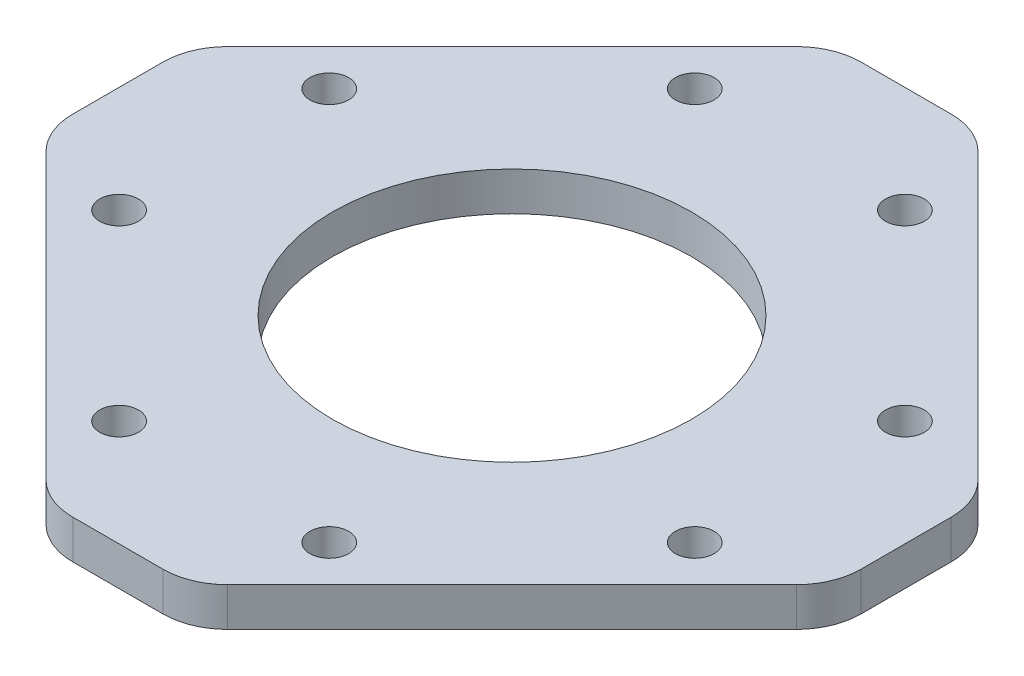
ISO-10303-21;
HEADER;
FILE_DESCRIPTION(('STEP AP214'),'2;1');
FILE_NAME('part.step','',(''),(''),'','','');
FILE_SCHEMA(('AUTOMOTIVE_DESIGN { 1 0 10303 214 1 1 1 1 }'));
ENDSEC;
DATA;
#1=APPLICATION_CONTEXT('core data for automotive mechanical design processes');
#2=APPLICATION_PROTOCOL_DEFINITION('international standard','automotive_design',2000,#1);
#3=PRODUCT_CONTEXT('',#1,'mechanical');
#4=PRODUCT('Part','Part','',(#3));
#5=PRODUCT_RELATED_PRODUCT_CATEGORY('part','',(#4));
#6=PRODUCT_DEFINITION_FORMATION('','',#4);
#7=PRODUCT_DEFINITION_CONTEXT('part definition',#1,'design');
#8=PRODUCT_DEFINITION('design','',#6,#7);
#9=PRODUCT_DEFINITION_SHAPE('','',#8);
#10=(LENGTH_UNIT() NAMED_UNIT(*) SI_UNIT(.MILLI.,.METRE.));
#11=(NAMED_UNIT(*) PLANE_ANGLE_UNIT() SI_UNIT($,.RADIAN.));
#12=(NAMED_UNIT(*) SI_UNIT($,.STERADIAN.) SOLID_ANGLE_UNIT());
#13=UNCERTAINTY_MEASURE_WITH_UNIT(LENGTH_MEASURE(1.E-05),#10,'distance_accuracy_value','');
#14=(GEOMETRIC_REPRESENTATION_CONTEXT(3) GLOBAL_UNCERTAINTY_ASSIGNED_CONTEXT((#13)) GLOBAL_UNIT_ASSIGNED_CONTEXT((#10,
#11,#12)) REPRESENTATION_CONTEXT('',''));
#15=CARTESIAN_POINT('',(0.,0.,0.));
#16=DIRECTION('',(0.,0.,1.));
#17=DIRECTION('',(1.,0.,0.));
#18=AXIS2_PLACEMENT_3D('',#15,#16,#17);
#19=CARTESIAN_POINT('',(3.49137802864851,3.,-25.5));
#20=DIRECTION('',(0.,1.,0.));
#21=DIRECTION('',(0.,0.,1.));
#22=AXIS2_PLACEMENT_3D('',#19,#20,#21);
#23=PLANE('',#22);
#24=CARTESIAN_POINT('',(-22.2738636073763,3.,-8.13172798364529));
#25=DIRECTION('',(0.,1.,0.));
#26=DIRECTION('',(0.,0.,1.));
#27=AXIS2_PLACEMENT_3D('',#24,#25,#26);
#28=CIRCLE('',#27,1.4999999999999);
#29=CARTESIAN_POINT('',(-22.2738636073763,3.,-6.63172798364539));
#30=VERTEX_POINT('',#29);
#31=EDGE_CURVE('E372',#30,#30,#28,.T.);
#32=ORIENTED_EDGE('',*,*,#31,.F.);
#33=EDGE_LOOP('',(#32));
#34=FACE_BOUND('',#33,.T.);
#35=CARTESIAN_POINT('',(-8.1317279836453,3.,-22.2738636073762));
#36=DIRECTION('',(0.,1.,0.));
#37=DIRECTION('',(0.,0.,1.));
#38=AXIS2_PLACEMENT_3D('',#35,#36,#37);
#39=CIRCLE('',#38,1.5);
#40=CARTESIAN_POINT('',(-8.1317279836453,3.,-20.7738636073762));
#41=VERTEX_POINT('',#40);
#42=EDGE_CURVE('E384',#41,#41,#39,.T.);
#43=ORIENTED_EDGE('',*,*,#42,.F.);
#44=EDGE_LOOP('',(#43));
#45=FACE_BOUND('',#44,.T.);
#46=CARTESIAN_POINT('',(22.2738636073762,3.,-8.1317279836453));
#47=DIRECTION('',(0.,1.,0.));
#48=DIRECTION('',(0.,0.,1.));
#49=AXIS2_PLACEMENT_3D('',#46,#47,#48);
#50=CIRCLE('',#49,1.5);
#51=CARTESIAN_POINT('',(22.2738636073762,3.,-6.6317279836453));
#52=VERTEX_POINT('',#51);
#53=EDGE_CURVE('E396',#52,#52,#50,.T.);
#54=ORIENTED_EDGE('',*,*,#53,.F.);
#55=EDGE_LOOP('',(#54));
#56=FACE_BOUND('',#55,.T.);
#57=CARTESIAN_POINT('',(8.13172798364529,3.,22.2738636073762));
#58=DIRECTION('',(0.,1.,0.));
#59=DIRECTION('',(0.,0.,1.));
#60=AXIS2_PLACEMENT_3D('',#57,#58,#59);
#61=CIRCLE('',#60,1.5);
#62=CARTESIAN_POINT('',(8.13172798364529,3.,23.7738636073762));
#63=VERTEX_POINT('',#62);
#64=EDGE_CURVE('E408',#63,#63,#61,.T.);
#65=ORIENTED_EDGE('',*,*,#64,.F.);
#66=EDGE_LOOP('',(#65));
#67=FACE_BOUND('',#66,.T.);
#68=CARTESIAN_POINT('',(3.49137802864851,3.,-25.5));
#69=DIRECTION('',(0.,1.,0.));
#70=DIRECTION('',(0.,0.,1.));
#71=AXIS2_PLACEMENT_3D('',#68,#69,#70);
#72=CIRCLE('',#71,4.99999999999999);
#73=CARTESIAN_POINT('',(7.02691193458125,3.,-29.0355339059327));
#74=VERTEX_POINT('',#73);
#75=CARTESIAN_POINT('',(3.49137802864851,3.,-30.5));
#76=VERTEX_POINT('',#75);
#77=EDGE_CURVE('E218',#74,#76,#72,.T.);
#78=ORIENTED_EDGE('',*,*,#77,.T.);
#79=DIRECTION('',(-1.,0.,0.));
#80=VECTOR('',#79,1.);
#81=CARTESIAN_POINT('',(3.49137802864851,3.,-30.5));
#82=LINE('',#81,#80);
#83=CARTESIAN_POINT('',(-3.4913780286485,3.,-30.5));
#84=VERTEX_POINT('',#83);
#85=EDGE_CURVE('E126',#76,#84,#82,.T.);
#86=ORIENTED_EDGE('',*,*,#85,.T.);
#87=CARTESIAN_POINT('',(-3.4913780286485,3.,-25.5));
#88=DIRECTION('',(0.,1.,0.));
#89=DIRECTION('',(0.,0.,1.));
#90=AXIS2_PLACEMENT_3D('',#87,#88,#89);
#91=CIRCLE('',#90,4.99999999999999);
#92=CARTESIAN_POINT('',(-7.02691193458124,3.,-29.0355339059327));
#93=VERTEX_POINT('',#92);
#94=EDGE_CURVE('E257',#84,#93,#91,.T.);
#95=ORIENTED_EDGE('',*,*,#94,.T.);
#96=DIRECTION('',(-0.707106781186547,0.,0.707106781186548));
#97=VECTOR('',#96,1.);
#98=CARTESIAN_POINT('',(-7.02691193458124,3.,-29.0355339059327));
#99=LINE('',#98,#97);
#100=CARTESIAN_POINT('',(-29.0355339059327,3.,-7.02691193458124));
#101=VERTEX_POINT('',#100);
#102=EDGE_CURVE('E276',#93,#101,#99,.T.);
#103=ORIENTED_EDGE('',*,*,#102,.T.);
#104=CARTESIAN_POINT('',(-25.5,3.,-3.4913780286485));
#105=DIRECTION('',(0.,1.,0.));
#106=DIRECTION('',(0.,0.,1.));
#107=AXIS2_PLACEMENT_3D('',#104,#105,#106);
#108=CIRCLE('',#107,4.99999999999999);
#109=CARTESIAN_POINT('',(-30.5,3.,-3.4913780286485));
#110=VERTEX_POINT('',#109);
#111=EDGE_CURVE('E273',#101,#110,#108,.T.);
#112=ORIENTED_EDGE('',*,*,#111,.T.);
#113=DIRECTION('',(0.,0.,1.));
#114=VECTOR('',#113,1.);
#115=CARTESIAN_POINT('',(-30.5,3.,-3.4913780286485));
#116=LINE('',#115,#114);
#117=CARTESIAN_POINT('',(-30.5,3.,3.4913780286485));
#118=VERTEX_POINT('',#117);
#119=EDGE_CURVE('E275',#110,#118,#116,.T.);
#120=ORIENTED_EDGE('',*,*,#119,.T.);
#121=CARTESIAN_POINT('',(-25.5,3.,3.4913780286485));
#122=DIRECTION('',(0.,1.,0.));
#123=DIRECTION('',(0.,0.,1.));
#124=AXIS2_PLACEMENT_3D('',#121,#122,#123);
#125=CIRCLE('',#124,4.99999999999999);
#126=CARTESIAN_POINT('',(-29.0355339059327,3.,7.02691193458123));
#127=VERTEX_POINT('',#126);
#128=EDGE_CURVE('E278',#118,#127,#125,.T.);
#129=ORIENTED_EDGE('',*,*,#128,.T.);
#130=DIRECTION('',(0.707106781186547,0.,0.707106781186548));
#131=VECTOR('',#130,1.);
#132=CARTESIAN_POINT('',(-29.0355339059327,3.,7.02691193458123));
#133=LINE('',#132,#131);
#134=CARTESIAN_POINT('',(-7.02691193458126,3.,29.0355339059327));
#135=VERTEX_POINT('',#134);
#136=EDGE_CURVE('E284',#127,#135,#133,.T.);
#137=ORIENTED_EDGE('',*,*,#136,.T.);
#138=CARTESIAN_POINT('',(-3.49137802864851,3.,25.5));
#139=DIRECTION('',(0.,1.,0.));
#140=DIRECTION('',(0.,0.,1.));
#141=AXIS2_PLACEMENT_3D('',#138,#139,#140);
#142=CIRCLE('',#141,4.99999999999999);
#143=CARTESIAN_POINT('',(-3.49137802864849,3.,30.5));
#144=VERTEX_POINT('',#143);
#145=EDGE_CURVE('E286',#135,#144,#142,.T.);
#146=ORIENTED_EDGE('',*,*,#145,.T.);
#147=DIRECTION('',(1.,0.,0.));
#148=VECTOR('',#147,1.);
#149=CARTESIAN_POINT('',(-3.49137802864849,3.,30.5));
#150=LINE('',#149,#148);
#151=CARTESIAN_POINT('',(3.49137802864853,3.,30.5));
#152=VERTEX_POINT('',#151);
#153=EDGE_CURVE('E288',#144,#152,#150,.T.);
#154=ORIENTED_EDGE('',*,*,#153,.T.);
#155=CARTESIAN_POINT('',(3.49137802864851,3.,25.5));
#156=DIRECTION('',(0.,1.,0.));
#157=DIRECTION('',(0.,0.,1.));
#158=AXIS2_PLACEMENT_3D('',#155,#156,#157);
#159=CIRCLE('',#158,4.99999999999999);
#160=CARTESIAN_POINT('',(7.02691193458125,3.,29.0355339059327));
#161=VERTEX_POINT('',#160);
#162=EDGE_CURVE('E290',#152,#161,#159,.T.);
#163=ORIENTED_EDGE('',*,*,#162,.T.);
#164=DIRECTION('',(0.707106781186547,0.,-0.707106781186548));
#165=VECTOR('',#164,1.);
#166=CARTESIAN_POINT('',(7.02691193458125,3.,29.0355339059327));
#167=LINE('',#166,#165);
#168=CARTESIAN_POINT('',(29.0355339059327,3.,7.02691193458124));
#169=VERTEX_POINT('',#168);
#170=EDGE_CURVE('E292',#161,#169,#167,.T.);
#171=ORIENTED_EDGE('',*,*,#170,.T.);
#172=CARTESIAN_POINT('',(25.5,3.,3.4913780286485));
#173=DIRECTION('',(0.,1.,0.));
#174=DIRECTION('',(0.,0.,1.));
#175=AXIS2_PLACEMENT_3D('',#172,#173,#174);
#176=CIRCLE('',#175,4.99999999999999);
#177=CARTESIAN_POINT('',(30.5,3.,3.4913780286485));
#178=VERTEX_POINT('',#177);
#179=EDGE_CURVE('E169',#169,#178,#176,.T.);
#180=ORIENTED_EDGE('',*,*,#179,.T.);
#181=DIRECTION('',(0.,0.,-1.));
#182=VECTOR('',#181,1.);
#183=CARTESIAN_POINT('',(30.5,3.,3.4913780286485));
#184=LINE('',#183,#182);
#185=CARTESIAN_POINT('',(30.5,3.,-3.49137802864851));
#186=VERTEX_POINT('',#185);
#187=EDGE_CURVE('E163',#178,#186,#184,.T.);
#188=ORIENTED_EDGE('',*,*,#187,.T.);
#189=CARTESIAN_POINT('',(25.5,3.,-3.49137802864851));
#190=DIRECTION('',(0.,1.,0.));
#191=DIRECTION('',(0.,0.,1.));
#192=AXIS2_PLACEMENT_3D('',#189,#190,#191);
#193=CIRCLE('',#192,4.99999999999999);
#194=CARTESIAN_POINT('',(29.0355339059327,3.,-7.02691193458125));
#195=VERTEX_POINT('',#194);
#196=EDGE_CURVE('E167',#186,#195,#193,.T.);
#197=ORIENTED_EDGE('',*,*,#196,.T.);
#198=DIRECTION('',(-0.707106781186547,0.,-0.707106781186547));
#199=VECTOR('',#198,1.);
#200=CARTESIAN_POINT('',(29.0355339059327,3.,-7.02691193458125));
#201=LINE('',#200,#199);
#202=EDGE_CURVE('E59',#195,#74,#201,.T.);
#203=ORIENTED_EDGE('',*,*,#202,.T.);
#204=EDGE_LOOP('',(#78,#86,#95,#103,#112,#120,#129,#137,#146,#154,#163,#171,#180,#188,#197,#203));
#205=FACE_BOUND('',#204,.T.);
#206=CARTESIAN_POINT('',(-8.1317279836453,3.,22.2738636073763));
#207=DIRECTION('',(0.,1.,0.));
#208=DIRECTION('',(0.,0.,1.));
#209=AXIS2_PLACEMENT_3D('',#206,#207,#208);
#210=CIRCLE('',#209,1.5);
#211=CARTESIAN_POINT('',(-8.1317279836453,3.,23.7738636073763));
#212=VERTEX_POINT('',#211);
#213=EDGE_CURVE('E191',#212,#212,#210,.T.);
#214=ORIENTED_EDGE('',*,*,#213,.F.);
#215=EDGE_LOOP('',(#214));
#216=FACE_BOUND('',#215,.T.);
#217=CARTESIAN_POINT('',(22.2738636073762,3.,8.1317279836453));
#218=DIRECTION('',(0.,1.,0.));
#219=DIRECTION('',(0.,0.,1.));
#220=AXIS2_PLACEMENT_3D('',#217,#218,#219);
#221=CIRCLE('',#220,1.5);
#222=CARTESIAN_POINT('',(22.2738636073762,3.,9.6317279836453));
#223=VERTEX_POINT('',#222);
#224=EDGE_CURVE('E402',#223,#223,#221,.T.);
#225=ORIENTED_EDGE('',*,*,#224,.F.);
#226=EDGE_LOOP('',(#225));
#227=FACE_BOUND('',#226,.T.);
#228=CARTESIAN_POINT('',(8.1317279836453,3.,-22.2738636073762));
#229=DIRECTION('',(0.,1.,0.));
#230=DIRECTION('',(0.,0.,1.));
#231=AXIS2_PLACEMENT_3D('',#228,#229,#230);
#232=CIRCLE('',#231,1.5);
#233=CARTESIAN_POINT('',(8.1317279836453,3.,-20.7738636073762));
#234=VERTEX_POINT('',#233);
#235=EDGE_CURVE('E390',#234,#234,#232,.T.);
#236=ORIENTED_EDGE('',*,*,#235,.F.);
#237=EDGE_LOOP('',(#236));
#238=FACE_BOUND('',#237,.T.);
#239=CARTESIAN_POINT('',(-22.2738636073762,3.,8.1317279836453));
#240=DIRECTION('',(0.,1.,0.));
#241=DIRECTION('',(0.,0.,1.));
#242=AXIS2_PLACEMENT_3D('',#239,#240,#241);
#243=CIRCLE('',#242,1.5);
#244=CARTESIAN_POINT('',(-22.2738636073762,3.,9.6317279836453));
#245=VERTEX_POINT('',#244);
#246=EDGE_CURVE('E378',#245,#245,#243,.T.);
#247=ORIENTED_EDGE('',*,*,#246,.F.);
#248=EDGE_LOOP('',(#247));
#249=FACE_BOUND('',#248,.T.);
#250=CARTESIAN_POINT('',(0.,3.,0.));
#251=DIRECTION('',(0.,1.,0.));
#252=DIRECTION('',(0.,0.,1.));
#253=AXIS2_PLACEMENT_3D('',#250,#251,#252);
#254=CIRCLE('',#253,13.9);
#255=CARTESIAN_POINT('',(0.,3.,13.9));
#256=VERTEX_POINT('',#255);
#257=EDGE_CURVE('E363',#256,#256,#254,.T.);
#258=ORIENTED_EDGE('',*,*,#257,.F.);
#259=EDGE_LOOP('',(#258));
#260=FACE_BOUND('',#259,.T.);
#261=ADVANCED_FACE('F42',(#34,#45,#56,#67,#205,#216,#227,#238,#249,#260),#23,.T.);
#262=CARTESIAN_POINT('',(3.49137802864851,0.,-25.5));
#263=DIRECTION('',(0.,1.,0.));
#264=DIRECTION('',(0.,0.,1.));
#265=AXIS2_PLACEMENT_3D('',#262,#263,#264);
#266=PLANE('',#265);
#267=CARTESIAN_POINT('',(3.49137802864851,0.,-25.5));
#268=DIRECTION('',(0.,1.,0.));
#269=DIRECTION('',(0.,0.,1.));
#270=AXIS2_PLACEMENT_3D('',#267,#268,#269);
#271=CIRCLE('',#270,4.99999999999999);
#272=CARTESIAN_POINT('',(7.02691193458125,0.,-29.0355339059327));
#273=VERTEX_POINT('',#272);
#274=CARTESIAN_POINT('',(3.49137802864851,0.,-30.5));
#275=VERTEX_POINT('',#274);
#276=EDGE_CURVE('E187',#273,#275,#271,.T.);
#277=ORIENTED_EDGE('',*,*,#276,.F.);
#278=DIRECTION('',(-0.707106781186547,0.,-0.707106781186547));
#279=VECTOR('',#278,1.);
#280=CARTESIAN_POINT('',(29.0355339059327,0.,-7.02691193458125));
#281=LINE('',#280,#279);
#282=CARTESIAN_POINT('',(29.0355339059327,0.,-7.02691193458125));
#283=VERTEX_POINT('',#282);
#284=EDGE_CURVE('E118',#283,#273,#281,.T.);
#285=ORIENTED_EDGE('',*,*,#284,.F.);
#286=CARTESIAN_POINT('',(25.5,0.,-3.49137802864851));
#287=DIRECTION('',(0.,1.,0.));
#288=DIRECTION('',(0.,0.,1.));
#289=AXIS2_PLACEMENT_3D('',#286,#287,#288);
#290=CIRCLE('',#289,4.99999999999999);
#291=CARTESIAN_POINT('',(30.5,0.,-3.49137802864851));
#292=VERTEX_POINT('',#291);
#293=EDGE_CURVE('E112',#292,#283,#290,.T.);
#294=ORIENTED_EDGE('',*,*,#293,.F.);
#295=DIRECTION('',(0.,0.,-1.));
#296=VECTOR('',#295,1.);
#297=CARTESIAN_POINT('',(30.5,0.,3.4913780286485));
#298=LINE('',#297,#296);
#299=CARTESIAN_POINT('',(30.5,0.,3.4913780286485));
#300=VERTEX_POINT('',#299);
#301=EDGE_CURVE('E177',#300,#292,#298,.T.);
#302=ORIENTED_EDGE('',*,*,#301,.F.);
#303=CARTESIAN_POINT('',(25.5,0.,3.4913780286485));
#304=DIRECTION('',(0.,1.,0.));
#305=DIRECTION('',(0.,0.,1.));
#306=AXIS2_PLACEMENT_3D('',#303,#304,#305);
#307=CIRCLE('',#306,4.99999999999999);
#308=CARTESIAN_POINT('',(29.0355339059327,0.,7.02691193458124));
#309=VERTEX_POINT('',#308);
#310=EDGE_CURVE('E213',#309,#300,#307,.T.);
#311=ORIENTED_EDGE('',*,*,#310,.F.);
#312=DIRECTION('',(0.707106781186547,0.,-0.707106781186548));
#313=VECTOR('',#312,1.);
#314=CARTESIAN_POINT('',(7.02691193458125,0.,29.0355339059327));
#315=LINE('',#314,#313);
#316=CARTESIAN_POINT('',(7.02691193458125,0.,29.0355339059327));
#317=VERTEX_POINT('',#316);
#318=EDGE_CURVE('E211',#317,#309,#315,.T.);
#319=ORIENTED_EDGE('',*,*,#318,.F.);
#320=CARTESIAN_POINT('',(3.49137802864851,0.,25.5));
#321=DIRECTION('',(0.,1.,0.));
#322=DIRECTION('',(0.,0.,1.));
#323=AXIS2_PLACEMENT_3D('',#320,#321,#322);
#324=CIRCLE('',#323,4.99999999999999);
#325=CARTESIAN_POINT('',(3.49137802864853,0.,30.5));
#326=VERTEX_POINT('',#325);
#327=EDGE_CURVE('E209',#326,#317,#324,.T.);
#328=ORIENTED_EDGE('',*,*,#327,.F.);
#329=DIRECTION('',(1.,0.,0.));
#330=VECTOR('',#329,1.);
#331=CARTESIAN_POINT('',(-3.49137802864849,0.,30.5));
#332=LINE('',#331,#330);
#333=CARTESIAN_POINT('',(-3.49137802864849,0.,30.5));
#334=VERTEX_POINT('',#333);
#335=EDGE_CURVE('E207',#334,#326,#332,.T.);
#336=ORIENTED_EDGE('',*,*,#335,.F.);
#337=CARTESIAN_POINT('',(-3.49137802864851,0.,25.5));
#338=DIRECTION('',(0.,1.,0.));
#339=DIRECTION('',(0.,0.,1.));
#340=AXIS2_PLACEMENT_3D('',#337,#338,#339);
#341=CIRCLE('',#340,4.99999999999999);
#342=CARTESIAN_POINT('',(-7.02691193458126,0.,29.0355339059327));
#343=VERTEX_POINT('',#342);
#344=EDGE_CURVE('E205',#343,#334,#341,.T.);
#345=ORIENTED_EDGE('',*,*,#344,.F.);
#346=DIRECTION('',(0.707106781186547,0.,0.707106781186548));
#347=VECTOR('',#346,1.);
#348=CARTESIAN_POINT('',(-29.0355339059327,0.,7.02691193458123));
#349=LINE('',#348,#347);
#350=CARTESIAN_POINT('',(-29.0355339059327,0.,7.02691193458123));
#351=VERTEX_POINT('',#350);
#352=EDGE_CURVE('E203',#351,#343,#349,.T.);
#353=ORIENTED_EDGE('',*,*,#352,.F.);
#354=CARTESIAN_POINT('',(-25.5,0.,3.4913780286485));
#355=DIRECTION('',(0.,1.,0.));
#356=DIRECTION('',(0.,0.,1.));
#357=AXIS2_PLACEMENT_3D('',#354,#355,#356);
#358=CIRCLE('',#357,4.99999999999999);
#359=CARTESIAN_POINT('',(-30.5,0.,3.4913780286485));
#360=VERTEX_POINT('',#359);
#361=EDGE_CURVE('E201',#360,#351,#358,.T.);
#362=ORIENTED_EDGE('',*,*,#361,.F.);
#363=DIRECTION('',(0.,0.,1.));
#364=VECTOR('',#363,1.);
#365=CARTESIAN_POINT('',(-30.5,0.,-3.4913780286485));
#366=LINE('',#365,#364);
#367=CARTESIAN_POINT('',(-30.5,0.,-3.4913780286485));
#368=VERTEX_POINT('',#367);
#369=EDGE_CURVE('E199',#368,#360,#366,.T.);
#370=ORIENTED_EDGE('',*,*,#369,.F.);
#371=CARTESIAN_POINT('',(-25.5,0.,-3.4913780286485));
#372=DIRECTION('',(0.,1.,0.));
#373=DIRECTION('',(0.,0.,1.));
#374=AXIS2_PLACEMENT_3D('',#371,#372,#373);
#375=CIRCLE('',#374,4.99999999999999);
#376=CARTESIAN_POINT('',(-29.0355339059327,0.,-7.02691193458124));
#377=VERTEX_POINT('',#376);
#378=EDGE_CURVE('E197',#377,#368,#375,.T.);
#379=ORIENTED_EDGE('',*,*,#378,.F.);
#380=DIRECTION('',(-0.707106781186547,0.,0.707106781186548));
#381=VECTOR('',#380,1.);
#382=CARTESIAN_POINT('',(-7.02691193458124,0.,-29.0355339059327));
#383=LINE('',#382,#381);
#384=CARTESIAN_POINT('',(-7.02691193458124,0.,-29.0355339059327));
#385=VERTEX_POINT('',#384);
#386=EDGE_CURVE('E195',#385,#377,#383,.T.);
#387=ORIENTED_EDGE('',*,*,#386,.F.);
#388=CARTESIAN_POINT('',(-3.4913780286485,0.,-25.5));
#389=DIRECTION('',(0.,1.,0.));
#390=DIRECTION('',(0.,0.,1.));
#391=AXIS2_PLACEMENT_3D('',#388,#389,#390);
#392=CIRCLE('',#391,4.99999999999999);
#393=CARTESIAN_POINT('',(-3.4913780286485,0.,-30.5));
#394=VERTEX_POINT('',#393);
#395=EDGE_CURVE('E193',#394,#385,#392,.T.);
#396=ORIENTED_EDGE('',*,*,#395,.F.);
#397=DIRECTION('',(-1.,0.,0.));
#398=VECTOR('',#397,1.);
#399=CARTESIAN_POINT('',(3.49137802864851,0.,-30.5));
#400=LINE('',#399,#398);
#401=EDGE_CURVE('E190',#275,#394,#400,.T.);
#402=ORIENTED_EDGE('',*,*,#401,.F.);
#403=EDGE_LOOP('',(#277,#285,#294,#302,#311,#319,#328,#336,#345,#353,#362,#370,#379,#387,#396,#402));
#404=FACE_BOUND('',#403,.T.);
#405=CARTESIAN_POINT('',(-8.1317279836453,0.,22.2738636073763));
#406=DIRECTION('',(0.,1.,0.));
#407=DIRECTION('',(0.,0.,1.));
#408=AXIS2_PLACEMENT_3D('',#405,#406,#407);
#409=CIRCLE('',#408,1.5);
#410=CARTESIAN_POINT('',(-8.1317279836453,0.,23.7738636073763));
#411=VERTEX_POINT('',#410);
#412=EDGE_CURVE('E411',#411,#411,#409,.T.);
#413=ORIENTED_EDGE('',*,*,#412,.T.);
#414=EDGE_LOOP('',(#413));
#415=FACE_BOUND('',#414,.T.);
#416=CARTESIAN_POINT('',(8.13172798364529,0.,22.2738636073762));
#417=DIRECTION('',(0.,1.,0.));
#418=DIRECTION('',(0.,0.,1.));
#419=AXIS2_PLACEMENT_3D('',#416,#417,#418);
#420=CIRCLE('',#419,1.5);
#421=CARTESIAN_POINT('',(8.13172798364529,0.,23.7738636073762));
#422=VERTEX_POINT('',#421);
#423=EDGE_CURVE('E405',#422,#422,#420,.T.);
#424=ORIENTED_EDGE('',*,*,#423,.T.);
#425=EDGE_LOOP('',(#424));
#426=FACE_BOUND('',#425,.T.);
#427=CARTESIAN_POINT('',(22.2738636073762,0.,8.1317279836453));
#428=DIRECTION('',(0.,1.,0.));
#429=DIRECTION('',(0.,0.,1.));
#430=AXIS2_PLACEMENT_3D('',#427,#428,#429);
#431=CIRCLE('',#430,1.5);
#432=CARTESIAN_POINT('',(22.2738636073762,0.,9.6317279836453));
#433=VERTEX_POINT('',#432);
#434=EDGE_CURVE('E399',#433,#433,#431,.T.);
#435=ORIENTED_EDGE('',*,*,#434,.T.);
#436=EDGE_LOOP('',(#435));
#437=FACE_BOUND('',#436,.T.);
#438=CARTESIAN_POINT('',(22.2738636073762,0.,-8.1317279836453));
#439=DIRECTION('',(0.,1.,0.));
#440=DIRECTION('',(0.,0.,1.));
#441=AXIS2_PLACEMENT_3D('',#438,#439,#440);
#442=CIRCLE('',#441,1.5);
#443=CARTESIAN_POINT('',(22.2738636073762,0.,-6.6317279836453));
#444=VERTEX_POINT('',#443);
#445=EDGE_CURVE('E393',#444,#444,#442,.T.);
#446=ORIENTED_EDGE('',*,*,#445,.T.);
#447=EDGE_LOOP('',(#446));
#448=FACE_BOUND('',#447,.T.);
#449=CARTESIAN_POINT('',(8.1317279836453,0.,-22.2738636073762));
#450=DIRECTION('',(0.,1.,0.));
#451=DIRECTION('',(0.,0.,1.));
#452=AXIS2_PLACEMENT_3D('',#449,#450,#451);
#453=CIRCLE('',#452,1.5);
#454=CARTESIAN_POINT('',(8.1317279836453,0.,-20.7738636073762));
#455=VERTEX_POINT('',#454);
#456=EDGE_CURVE('E387',#455,#455,#453,.T.);
#457=ORIENTED_EDGE('',*,*,#456,.T.);
#458=EDGE_LOOP('',(#457));
#459=FACE_BOUND('',#458,.T.);
#460=CARTESIAN_POINT('',(-8.1317279836453,0.,-22.2738636073762));
#461=DIRECTION('',(0.,1.,0.));
#462=DIRECTION('',(0.,0.,1.));
#463=AXIS2_PLACEMENT_3D('',#460,#461,#462);
#464=CIRCLE('',#463,1.5);
#465=CARTESIAN_POINT('',(-8.1317279836453,0.,-20.7738636073762));
#466=VERTEX_POINT('',#465);
#467=EDGE_CURVE('E381',#466,#466,#464,.T.);
#468=ORIENTED_EDGE('',*,*,#467,.T.);
#469=EDGE_LOOP('',(#468));
#470=FACE_BOUND('',#469,.T.);
#471=CARTESIAN_POINT('',(-22.2738636073762,0.,8.1317279836453));
#472=DIRECTION('',(0.,1.,0.));
#473=DIRECTION('',(0.,0.,1.));
#474=AXIS2_PLACEMENT_3D('',#471,#472,#473);
#475=CIRCLE('',#474,1.5);
#476=CARTESIAN_POINT('',(-22.2738636073762,0.,9.6317279836453));
#477=VERTEX_POINT('',#476);
#478=EDGE_CURVE('E375',#477,#477,#475,.T.);
#479=ORIENTED_EDGE('',*,*,#478,.T.);
#480=EDGE_LOOP('',(#479));
#481=FACE_BOUND('',#480,.T.);
#482=CARTESIAN_POINT('',(-22.2738636073763,0.,-8.13172798364529));
#483=DIRECTION('',(0.,1.,0.));
#484=DIRECTION('',(0.,0.,1.));
#485=AXIS2_PLACEMENT_3D('',#482,#483,#484);
#486=CIRCLE('',#485,1.4999999999999);
#487=CARTESIAN_POINT('',(-22.2738636073763,0.,-6.63172798364539));
#488=VERTEX_POINT('',#487);
#489=EDGE_CURVE('E369',#488,#488,#486,.T.);
#490=ORIENTED_EDGE('',*,*,#489,.T.);
#491=EDGE_LOOP('',(#490));
#492=FACE_BOUND('',#491,.T.);
#493=CARTESIAN_POINT('',(0.,0.,0.));
#494=DIRECTION('',(0.,1.,0.));
#495=DIRECTION('',(0.,0.,1.));
#496=AXIS2_PLACEMENT_3D('',#493,#494,#495);
#497=CIRCLE('',#496,13.9);
#498=CARTESIAN_POINT('',(0.,0.,13.9));
#499=VERTEX_POINT('',#498);
#500=EDGE_CURVE('E366',#499,#499,#497,.T.);
#501=ORIENTED_EDGE('',*,*,#500,.T.);
#502=EDGE_LOOP('',(#501));
#503=FACE_BOUND('',#502,.T.);
#504=ADVANCED_FACE('F261',(#404,#415,#426,#437,#448,#459,#470,#481,#492,#503),#266,.F.);
#505=CARTESIAN_POINT('',(3.49137802864851,3.,-25.5));
#506=DIRECTION('',(0.,-1.,0.));
#507=DIRECTION('',(0.,0.,-1.));
#508=AXIS2_PLACEMENT_3D('',#505,#506,#507);
#509=CYLINDRICAL_SURFACE('',#508,4.99999999999999);
#510=ORIENTED_EDGE('',*,*,#276,.T.);
#511=DIRECTION('',(0.,-1.,0.));
#512=VECTOR('',#511,1.);
#513=CARTESIAN_POINT('',(3.49137802864851,3.,-30.5));
#514=LINE('',#513,#512);
#515=EDGE_CURVE('E11',#76,#275,#514,.T.);
#516=ORIENTED_EDGE('',*,*,#515,.F.);
#517=ORIENTED_EDGE('',*,*,#77,.F.);
#518=DIRECTION('',(0.,-1.,0.));
#519=VECTOR('',#518,1.);
#520=CARTESIAN_POINT('',(7.02691193458125,3.,-29.0355339059327));
#521=LINE('',#520,#519);
#522=EDGE_CURVE('E183',#74,#273,#521,.T.);
#523=ORIENTED_EDGE('',*,*,#522,.T.);
#524=EDGE_LOOP('',(#510,#516,#517,#523));
#525=FACE_BOUND('',#524,.T.);
#526=ADVANCED_FACE('F44',(#525),#509,.T.);
#527=CARTESIAN_POINT('',(3.49137802864851,3.,-30.5));
#528=DIRECTION('',(0.,0.,1.));
#529=DIRECTION('',(1.,0.,0.));
#530=AXIS2_PLACEMENT_3D('',#527,#528,#529);
#531=PLANE('',#530);
#532=ORIENTED_EDGE('',*,*,#401,.T.);
#533=DIRECTION('',(0.,-1.,0.));
#534=VECTOR('',#533,1.);
#535=CARTESIAN_POINT('',(-3.4913780286485,3.,-30.5));
#536=LINE('',#535,#534);
#537=EDGE_CURVE('E51',#84,#394,#536,.T.);
#538=ORIENTED_EDGE('',*,*,#537,.F.);
#539=ORIENTED_EDGE('',*,*,#85,.F.);
#540=ORIENTED_EDGE('',*,*,#515,.T.);
#541=EDGE_LOOP('',(#532,#538,#539,#540));
#542=FACE_BOUND('',#541,.T.);
#543=ADVANCED_FACE('F615',(#542),#531,.F.);
#544=CARTESIAN_POINT('',(-3.4913780286485,3.,-25.5));
#545=DIRECTION('',(0.,-1.,0.));
#546=DIRECTION('',(0.,0.,-1.));
#547=AXIS2_PLACEMENT_3D('',#544,#545,#546);
#548=CYLINDRICAL_SURFACE('',#547,4.99999999999999);
#549=ORIENTED_EDGE('',*,*,#395,.T.);
#550=DIRECTION('',(0.,-1.,0.));
#551=VECTOR('',#550,1.);
#552=CARTESIAN_POINT('',(-7.02691193458124,3.,-29.0355339059327));
#553=LINE('',#552,#551);
#554=EDGE_CURVE('E249',#93,#385,#553,.T.);
#555=ORIENTED_EDGE('',*,*,#554,.F.);
#556=ORIENTED_EDGE('',*,*,#94,.F.);
#557=ORIENTED_EDGE('',*,*,#537,.T.);
#558=EDGE_LOOP('',(#549,#555,#556,#557));
#559=FACE_BOUND('',#558,.T.);
#560=ADVANCED_FACE('F255',(#559),#548,.T.);
#561=CARTESIAN_POINT('',(-7.02691193458124,3.,-29.0355339059327));
#562=DIRECTION('',(0.707106781186548,0.,0.707106781186547));
#563=DIRECTION('',(0.707106781186547,0.,-0.707106781186548));
#564=AXIS2_PLACEMENT_3D('',#561,#562,#563);
#565=PLANE('',#564);
#566=ORIENTED_EDGE('',*,*,#386,.T.);
#567=DIRECTION('',(0.,-1.,0.));
#568=VECTOR('',#567,1.);
#569=CARTESIAN_POINT('',(-29.0355339059327,3.,-7.02691193458124));
#570=LINE('',#569,#568);
#571=EDGE_CURVE('E246',#101,#377,#570,.T.);
#572=ORIENTED_EDGE('',*,*,#571,.F.);
#573=ORIENTED_EDGE('',*,*,#102,.F.);
#574=ORIENTED_EDGE('',*,*,#554,.T.);
#575=EDGE_LOOP('',(#566,#572,#573,#574));
#576=FACE_BOUND('',#575,.T.);
#577=ADVANCED_FACE('F267',(#576),#565,.F.);
#578=CARTESIAN_POINT('',(-25.5,3.,-3.4913780286485));
#579=DIRECTION('',(0.,-1.,0.));
#580=DIRECTION('',(0.,0.,-1.));
#581=AXIS2_PLACEMENT_3D('',#578,#579,#580);
#582=CYLINDRICAL_SURFACE('',#581,4.99999999999999);
#583=ORIENTED_EDGE('',*,*,#378,.T.);
#584=DIRECTION('',(0.,-1.,0.));
#585=VECTOR('',#584,1.);
#586=CARTESIAN_POINT('',(-30.5,3.,-3.4913780286485));
#587=LINE('',#586,#585);
#588=EDGE_CURVE('E243',#110,#368,#587,.T.);
#589=ORIENTED_EDGE('',*,*,#588,.F.);
#590=ORIENTED_EDGE('',*,*,#111,.F.);
#591=ORIENTED_EDGE('',*,*,#571,.T.);
#592=EDGE_LOOP('',(#583,#589,#590,#591));
#593=FACE_BOUND('',#592,.T.);
#594=ADVANCED_FACE('F271',(#593),#582,.T.);
#595=CARTESIAN_POINT('',(-30.5,3.,-3.4913780286485));
#596=DIRECTION('',(1.,0.,0.));
#597=DIRECTION('',(0.,0.,-1.));
#598=AXIS2_PLACEMENT_3D('',#595,#596,#597);
#599=PLANE('',#598);
#600=ORIENTED_EDGE('',*,*,#369,.T.);
#601=DIRECTION('',(0.,-1.,0.));
#602=VECTOR('',#601,1.);
#603=CARTESIAN_POINT('',(-30.5,3.,3.4913780286485));
#604=LINE('',#603,#602);
#605=EDGE_CURVE('E240',#118,#360,#604,.T.);
#606=ORIENTED_EDGE('',*,*,#605,.F.);
#607=ORIENTED_EDGE('',*,*,#119,.F.);
#608=ORIENTED_EDGE('',*,*,#588,.T.);
#609=EDGE_LOOP('',(#600,#606,#607,#608));
#610=FACE_BOUND('',#609,.T.);
#611=ADVANCED_FACE('F580',(#610),#599,.F.);
#612=CARTESIAN_POINT('',(-25.5,3.,3.4913780286485));
#613=DIRECTION('',(0.,-1.,0.));
#614=DIRECTION('',(0.,0.,-1.));
#615=AXIS2_PLACEMENT_3D('',#612,#613,#614);
#616=CYLINDRICAL_SURFACE('',#615,4.99999999999999);
#617=ORIENTED_EDGE('',*,*,#361,.T.);
#618=DIRECTION('',(0.,-1.,0.));
#619=VECTOR('',#618,1.);
#620=CARTESIAN_POINT('',(-29.0355339059327,3.,7.02691193458123));
#621=LINE('',#620,#619);
#622=EDGE_CURVE('E237',#127,#351,#621,.T.);
#623=ORIENTED_EDGE('',*,*,#622,.F.);
#624=ORIENTED_EDGE('',*,*,#128,.F.);
#625=ORIENTED_EDGE('',*,*,#605,.T.);
#626=EDGE_LOOP('',(#617,#623,#624,#625));
#627=FACE_BOUND('',#626,.T.);
#628=ADVANCED_FACE('F570',(#627),#616,.T.);
#629=CARTESIAN_POINT('',(-29.0355339059327,3.,7.02691193458123));
#630=DIRECTION('',(0.707106781186548,0.,-0.707106781186547));
#631=DIRECTION('',(-0.707106781186547,0.,-0.707106781186548));
#632=AXIS2_PLACEMENT_3D('',#629,#630,#631);
#633=PLANE('',#632);
#634=ORIENTED_EDGE('',*,*,#352,.T.);
#635=DIRECTION('',(0.,-1.,0.));
#636=VECTOR('',#635,1.);
#637=CARTESIAN_POINT('',(-7.02691193458126,3.,29.0355339059327));
#638=LINE('',#637,#636);
#639=EDGE_CURVE('E234',#135,#343,#638,.T.);
#640=ORIENTED_EDGE('',*,*,#639,.F.);
#641=ORIENTED_EDGE('',*,*,#136,.F.);
#642=ORIENTED_EDGE('',*,*,#622,.T.);
#643=EDGE_LOOP('',(#634,#640,#641,#642));
#644=FACE_BOUND('',#643,.T.);
#645=ADVANCED_FACE('F560',(#644),#633,.F.);
#646=CARTESIAN_POINT('',(-3.49137802864851,3.,25.5));
#647=DIRECTION('',(0.,-1.,0.));
#648=DIRECTION('',(0.,0.,-1.));
#649=AXIS2_PLACEMENT_3D('',#646,#647,#648);
#650=CYLINDRICAL_SURFACE('',#649,4.99999999999999);
#651=ORIENTED_EDGE('',*,*,#344,.T.);
#652=DIRECTION('',(0.,-1.,0.));
#653=VECTOR('',#652,1.);
#654=CARTESIAN_POINT('',(-3.49137802864849,3.,30.5));
#655=LINE('',#654,#653);
#656=EDGE_CURVE('E231',#144,#334,#655,.T.);
#657=ORIENTED_EDGE('',*,*,#656,.F.);
#658=ORIENTED_EDGE('',*,*,#145,.F.);
#659=ORIENTED_EDGE('',*,*,#639,.T.);
#660=EDGE_LOOP('',(#651,#657,#658,#659));
#661=FACE_BOUND('',#660,.T.);
#662=ADVANCED_FACE('F550',(#661),#650,.T.);
#663=CARTESIAN_POINT('',(-3.49137802864849,3.,30.5));
#664=DIRECTION('',(0.,0.,-1.));
#665=DIRECTION('',(-1.,0.,0.));
#666=AXIS2_PLACEMENT_3D('',#663,#664,#665);
#667=PLANE('',#666);
#668=ORIENTED_EDGE('',*,*,#335,.T.);
#669=DIRECTION('',(0.,-1.,0.));
#670=VECTOR('',#669,1.);
#671=CARTESIAN_POINT('',(3.49137802864853,3.,30.5));
#672=LINE('',#671,#670);
#673=EDGE_CURVE('E228',#152,#326,#672,.T.);
#674=ORIENTED_EDGE('',*,*,#673,.F.);
#675=ORIENTED_EDGE('',*,*,#153,.F.);
#676=ORIENTED_EDGE('',*,*,#656,.T.);
#677=EDGE_LOOP('',(#668,#674,#675,#676));
#678=FACE_BOUND('',#677,.T.);
#679=ADVANCED_FACE('F540',(#678),#667,.F.);
#680=CARTESIAN_POINT('',(3.49137802864851,3.,25.5));
#681=DIRECTION('',(0.,-1.,0.));
#682=DIRECTION('',(0.,0.,-1.));
#683=AXIS2_PLACEMENT_3D('',#680,#681,#682);
#684=CYLINDRICAL_SURFACE('',#683,4.99999999999999);
#685=ORIENTED_EDGE('',*,*,#327,.T.);
#686=DIRECTION('',(0.,-1.,0.));
#687=VECTOR('',#686,1.);
#688=CARTESIAN_POINT('',(7.02691193458125,3.,29.0355339059327));
#689=LINE('',#688,#687);
#690=EDGE_CURVE('E225',#161,#317,#689,.T.);
#691=ORIENTED_EDGE('',*,*,#690,.F.);
#692=ORIENTED_EDGE('',*,*,#162,.F.);
#693=ORIENTED_EDGE('',*,*,#673,.T.);
#694=EDGE_LOOP('',(#685,#691,#692,#693));
#695=FACE_BOUND('',#694,.T.);
#696=ADVANCED_FACE('F531',(#695),#684,.T.);
#697=CARTESIAN_POINT('',(7.02691193458125,3.,29.0355339059327));
#698=DIRECTION('',(-0.707106781186548,0.,-0.707106781186547));
#699=DIRECTION('',(-0.707106781186547,0.,0.707106781186548));
#700=AXIS2_PLACEMENT_3D('',#697,#698,#699);
#701=PLANE('',#700);
#702=ORIENTED_EDGE('',*,*,#318,.T.);
#703=DIRECTION('',(0.,-1.,0.));
#704=VECTOR('',#703,1.);
#705=CARTESIAN_POINT('',(29.0355339059327,3.,7.02691193458124));
#706=LINE('',#705,#704);
#707=EDGE_CURVE('E222',#169,#309,#706,.T.);
#708=ORIENTED_EDGE('',*,*,#707,.F.);
#709=ORIENTED_EDGE('',*,*,#170,.F.);
#710=ORIENTED_EDGE('',*,*,#690,.T.);
#711=EDGE_LOOP('',(#702,#708,#709,#710));
#712=FACE_BOUND('',#711,.T.);
#713=ADVANCED_FACE('F298',(#712),#701,.F.);
#714=CARTESIAN_POINT('',(25.5,3.,3.4913780286485));
#715=DIRECTION('',(0.,-1.,0.));
#716=DIRECTION('',(0.,0.,-1.));
#717=AXIS2_PLACEMENT_3D('',#714,#715,#716);
#718=CYLINDRICAL_SURFACE('',#717,4.99999999999999);
#719=ORIENTED_EDGE('',*,*,#310,.T.);
#720=DIRECTION('',(0.,-1.,0.));
#721=VECTOR('',#720,1.);
#722=CARTESIAN_POINT('',(30.5,3.,3.4913780286485));
#723=LINE('',#722,#721);
#724=EDGE_CURVE('E178',#178,#300,#723,.T.);
#725=ORIENTED_EDGE('',*,*,#724,.F.);
#726=ORIENTED_EDGE('',*,*,#179,.F.);
#727=ORIENTED_EDGE('',*,*,#707,.T.);
#728=EDGE_LOOP('',(#719,#725,#726,#727));
#729=FACE_BOUND('',#728,.T.);
#730=ADVANCED_FACE('F302',(#729),#718,.T.);
#731=CARTESIAN_POINT('',(30.5,3.,3.4913780286485));
#732=DIRECTION('',(-1.,0.,0.));
#733=DIRECTION('',(0.,0.,1.));
#734=AXIS2_PLACEMENT_3D('',#731,#732,#733);
#735=PLANE('',#734);
#736=ORIENTED_EDGE('',*,*,#301,.T.);
#737=DIRECTION('',(0.,-1.,0.));
#738=VECTOR('',#737,1.);
#739=CARTESIAN_POINT('',(30.5,3.,-3.49137802864851));
#740=LINE('',#739,#738);
#741=EDGE_CURVE('E174',#186,#292,#740,.T.);
#742=ORIENTED_EDGE('',*,*,#741,.F.);
#743=ORIENTED_EDGE('',*,*,#187,.F.);
#744=ORIENTED_EDGE('',*,*,#724,.T.);
#745=EDGE_LOOP('',(#736,#742,#743,#744));
#746=FACE_BOUND('',#745,.T.);
#747=ADVANCED_FACE('F175',(#746),#735,.F.);
#748=CARTESIAN_POINT('',(25.5,3.,-3.49137802864851));
#749=DIRECTION('',(0.,-1.,0.));
#750=DIRECTION('',(0.,0.,-1.));
#751=AXIS2_PLACEMENT_3D('',#748,#749,#750);
#752=CYLINDRICAL_SURFACE('',#751,4.99999999999999);
#753=ORIENTED_EDGE('',*,*,#293,.T.);
#754=DIRECTION('',(0.,-1.,0.));
#755=VECTOR('',#754,1.);
#756=CARTESIAN_POINT('',(29.0355339059327,3.,-7.02691193458125));
#757=LINE('',#756,#755);
#758=EDGE_CURVE('E179',#195,#283,#757,.T.);
#759=ORIENTED_EDGE('',*,*,#758,.F.);
#760=ORIENTED_EDGE('',*,*,#196,.F.);
#761=ORIENTED_EDGE('',*,*,#741,.T.);
#762=EDGE_LOOP('',(#753,#759,#760,#761));
#763=FACE_BOUND('',#762,.T.);
#764=ADVANCED_FACE('F181',(#763),#752,.T.);
#765=CARTESIAN_POINT('',(29.0355339059327,3.,-7.02691193458125));
#766=DIRECTION('',(-0.707106781186548,0.,0.707106781186548));
#767=DIRECTION('',(0.707106781186548,0.,0.707106781186548));
#768=AXIS2_PLACEMENT_3D('',#765,#766,#767);
#769=PLANE('',#768);
#770=ORIENTED_EDGE('',*,*,#284,.T.);
#771=ORIENTED_EDGE('',*,*,#522,.F.);
#772=ORIENTED_EDGE('',*,*,#202,.F.);
#773=ORIENTED_EDGE('',*,*,#758,.T.);
#774=EDGE_LOOP('',(#770,#771,#772,#773));
#775=FACE_BOUND('',#774,.T.);
#776=ADVANCED_FACE('F306',(#775),#769,.F.);
#777=CARTESIAN_POINT('',(-8.1317279836453,3.,22.2738636073763));
#778=DIRECTION('',(0.,-1.,0.));
#779=DIRECTION('',(0.,0.,-1.));
#780=AXIS2_PLACEMENT_3D('',#777,#778,#779);
#781=CYLINDRICAL_SURFACE('',#780,1.5);
#782=ORIENTED_EDGE('',*,*,#213,.T.);
#783=EDGE_LOOP('',(#782));
#784=FACE_BOUND('',#783,.T.);
#785=ORIENTED_EDGE('',*,*,#412,.F.);
#786=EDGE_LOOP('',(#785));
#787=FACE_BOUND('',#786,.T.);
#788=ADVANCED_FACE('F308',(#784,#787),#781,.F.);
#789=CARTESIAN_POINT('',(8.13172798364529,3.,22.2738636073762));
#790=DIRECTION('',(0.,-1.,0.));
#791=DIRECTION('',(0.,0.,-1.));
#792=AXIS2_PLACEMENT_3D('',#789,#790,#791);
#793=CYLINDRICAL_SURFACE('',#792,1.5);
#794=ORIENTED_EDGE('',*,*,#64,.T.);
#795=EDGE_LOOP('',(#794));
#796=FACE_BOUND('',#795,.T.);
#797=ORIENTED_EDGE('',*,*,#423,.F.);
#798=EDGE_LOOP('',(#797));
#799=FACE_BOUND('',#798,.T.);
#800=ADVANCED_FACE('F314',(#796,#799),#793,.F.);
#801=CARTESIAN_POINT('',(22.2738636073762,3.,8.1317279836453));
#802=DIRECTION('',(0.,-1.,0.));
#803=DIRECTION('',(0.,0.,-1.));
#804=AXIS2_PLACEMENT_3D('',#801,#802,#803);
#805=CYLINDRICAL_SURFACE('',#804,1.5);
#806=ORIENTED_EDGE('',*,*,#224,.T.);
#807=EDGE_LOOP('',(#806));
#808=FACE_BOUND('',#807,.T.);
#809=ORIENTED_EDGE('',*,*,#434,.F.);
#810=EDGE_LOOP('',(#809));
#811=FACE_BOUND('',#810,.T.);
#812=ADVANCED_FACE('F330',(#808,#811),#805,.F.);
#813=CARTESIAN_POINT('',(22.2738636073762,3.,-8.1317279836453));
#814=DIRECTION('',(0.,-1.,0.));
#815=DIRECTION('',(0.,0.,-1.));
#816=AXIS2_PLACEMENT_3D('',#813,#814,#815);
#817=CYLINDRICAL_SURFACE('',#816,1.5);
#818=ORIENTED_EDGE('',*,*,#53,.T.);
#819=EDGE_LOOP('',(#818));
#820=FACE_BOUND('',#819,.T.);
#821=ORIENTED_EDGE('',*,*,#445,.F.);
#822=EDGE_LOOP('',(#821));
#823=FACE_BOUND('',#822,.T.);
#824=ADVANCED_FACE('F334',(#820,#823),#817,.F.);
#825=CARTESIAN_POINT('',(8.1317279836453,3.,-22.2738636073762));
#826=DIRECTION('',(0.,-1.,0.));
#827=DIRECTION('',(0.,0.,-1.));
#828=AXIS2_PLACEMENT_3D('',#825,#826,#827);
#829=CYLINDRICAL_SURFACE('',#828,1.5);
#830=ORIENTED_EDGE('',*,*,#235,.T.);
#831=EDGE_LOOP('',(#830));
#832=FACE_BOUND('',#831,.T.);
#833=ORIENTED_EDGE('',*,*,#456,.F.);
#834=EDGE_LOOP('',(#833));
#835=FACE_BOUND('',#834,.T.);
#836=ADVANCED_FACE('F338',(#832,#835),#829,.F.);
#837=CARTESIAN_POINT('',(-8.1317279836453,3.,-22.2738636073762));
#838=DIRECTION('',(0.,-1.,0.));
#839=DIRECTION('',(0.,0.,-1.));
#840=AXIS2_PLACEMENT_3D('',#837,#838,#839);
#841=CYLINDRICAL_SURFACE('',#840,1.5);
#842=ORIENTED_EDGE('',*,*,#42,.T.);
#843=EDGE_LOOP('',(#842));
#844=FACE_BOUND('',#843,.T.);
#845=ORIENTED_EDGE('',*,*,#467,.F.);
#846=EDGE_LOOP('',(#845));
#847=FACE_BOUND('',#846,.T.);
#848=ADVANCED_FACE('F342',(#844,#847),#841,.F.);
#849=CARTESIAN_POINT('',(-22.2738636073762,3.,8.1317279836453));
#850=DIRECTION('',(0.,-1.,0.));
#851=DIRECTION('',(0.,0.,-1.));
#852=AXIS2_PLACEMENT_3D('',#849,#850,#851);
#853=CYLINDRICAL_SURFACE('',#852,1.5);
#854=ORIENTED_EDGE('',*,*,#246,.T.);
#855=EDGE_LOOP('',(#854));
#856=FACE_BOUND('',#855,.T.);
#857=ORIENTED_EDGE('',*,*,#478,.F.);
#858=EDGE_LOOP('',(#857));
#859=FACE_BOUND('',#858,.T.);
#860=ADVANCED_FACE('F346',(#856,#859),#853,.F.);
#861=CARTESIAN_POINT('',(-22.2738636073763,3.,-8.13172798364529));
#862=DIRECTION('',(0.,-1.,0.));
#863=DIRECTION('',(0.,0.,-1.));
#864=AXIS2_PLACEMENT_3D('',#861,#862,#863);
#865=CYLINDRICAL_SURFACE('',#864,1.4999999999999);
#866=ORIENTED_EDGE('',*,*,#31,.T.);
#867=EDGE_LOOP('',(#866));
#868=FACE_BOUND('',#867,.T.);
#869=ORIENTED_EDGE('',*,*,#489,.F.);
#870=EDGE_LOOP('',(#869));
#871=FACE_BOUND('',#870,.T.);
#872=ADVANCED_FACE('F350',(#868,#871),#865,.F.);
#873=CARTESIAN_POINT('',(0.,3.,0.));
#874=DIRECTION('',(0.,-1.,0.));
#875=DIRECTION('',(0.,0.,-1.));
#876=AXIS2_PLACEMENT_3D('',#873,#874,#875);
#877=CYLINDRICAL_SURFACE('',#876,13.9);
#878=ORIENTED_EDGE('',*,*,#257,.T.);
#879=EDGE_LOOP('',(#878));
#880=FACE_BOUND('',#879,.T.);
#881=ORIENTED_EDGE('',*,*,#500,.F.);
#882=EDGE_LOOP('',(#881));
#883=FACE_BOUND('',#882,.T.);
#884=ADVANCED_FACE('F354',(#880,#883),#877,.F.);
#885=CLOSED_SHELL('',(#261,#504,#526,#543,#560,#577,#594,#611,#628,#645,#662,#679,#696,#713,
#730,#747,#764,#776,#788,#800,#812,#824,#836,#848,#860,#872,#884));
#886=MANIFOLD_SOLID_BREP('B2',#885);
#887=ADVANCED_BREP_SHAPE_REPRESENTATION('',(#18,#886),#14);
#888=SHAPE_DEFINITION_REPRESENTATION(#9,#887);
ENDSEC;
END-ISO-10303-21;
